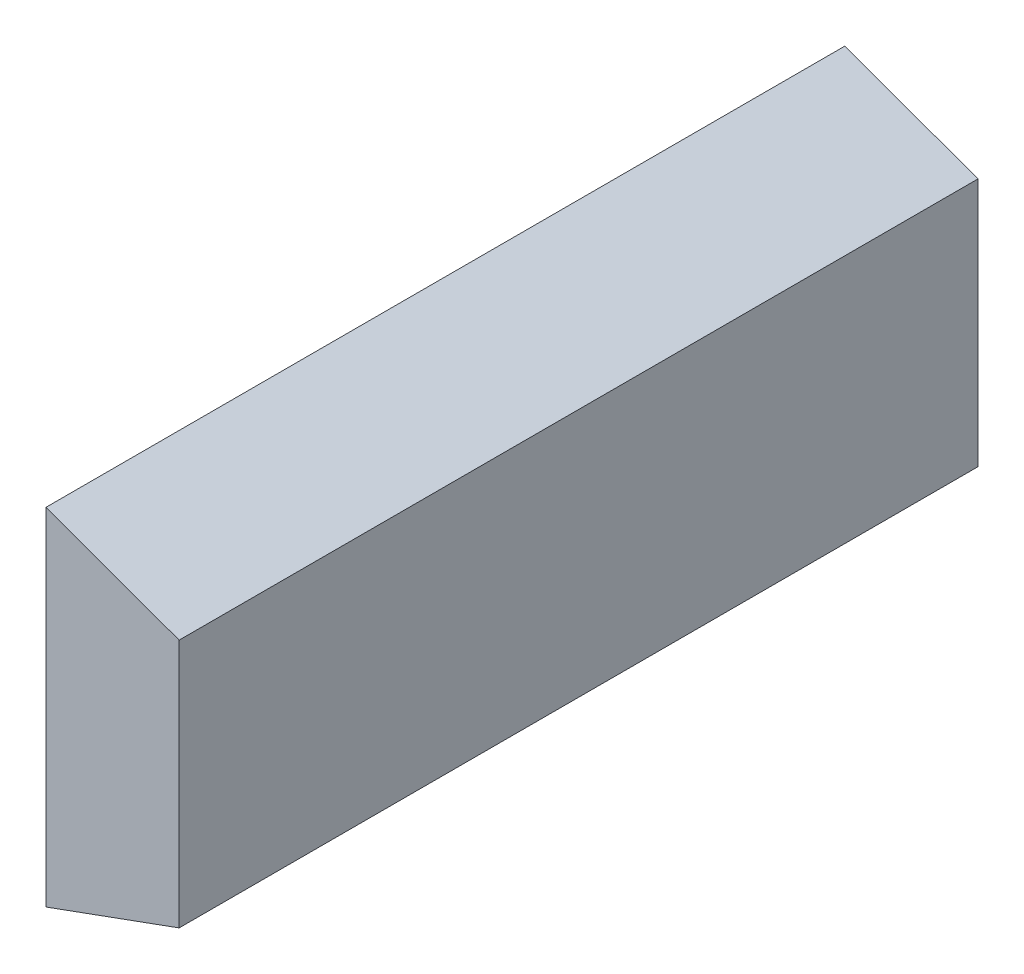
ISO-10303-21;
HEADER;
FILE_DESCRIPTION(('STEP AP214'),'2;1');
FILE_NAME('part.step','',(''),(''),'','','');
FILE_SCHEMA(('AUTOMOTIVE_DESIGN { 1 0 10303 214 1 1 1 1 }'));
ENDSEC;
DATA;
#1=APPLICATION_CONTEXT('core data for automotive mechanical design processes');
#2=APPLICATION_PROTOCOL_DEFINITION('international standard','automotive_design',2000,#1);
#3=PRODUCT_CONTEXT('',#1,'mechanical');
#4=PRODUCT('Part','Part','',(#3));
#5=PRODUCT_RELATED_PRODUCT_CATEGORY('part','',(#4));
#6=PRODUCT_DEFINITION_FORMATION('','',#4);
#7=PRODUCT_DEFINITION_CONTEXT('part definition',#1,'design');
#8=PRODUCT_DEFINITION('design','',#6,#7);
#9=PRODUCT_DEFINITION_SHAPE('','',#8);
#10=(LENGTH_UNIT() NAMED_UNIT(*) SI_UNIT(.MILLI.,.METRE.));
#11=(NAMED_UNIT(*) PLANE_ANGLE_UNIT() SI_UNIT($,.RADIAN.));
#12=(NAMED_UNIT(*) SI_UNIT($,.STERADIAN.) SOLID_ANGLE_UNIT());
#13=UNCERTAINTY_MEASURE_WITH_UNIT(LENGTH_MEASURE(1.E-05),#10,'distance_accuracy_value','');
#14=(GEOMETRIC_REPRESENTATION_CONTEXT(3) GLOBAL_UNCERTAINTY_ASSIGNED_CONTEXT((#13)) GLOBAL_UNIT_ASSIGNED_CONTEXT((#10,
#11,#12)) REPRESENTATION_CONTEXT('',''));
#15=CARTESIAN_POINT('',(0.,0.,0.));
#16=DIRECTION('',(0.,0.,1.));
#17=DIRECTION('',(1.,0.,0.));
#18=AXIS2_PLACEMENT_3D('',#15,#16,#17);
#19=CARTESIAN_POINT('',(61.7537089471515,-18.1549026853682,-15.));
#20=DIRECTION('',(0.34202014332567,0.939692620785908,0.));
#21=DIRECTION('',(-0.939692620785908,0.34202014332567,0.));
#22=AXIS2_PLACEMENT_3D('',#19,#20,#21);
#23=PLANE('',#22);
#24=DIRECTION('',(-0.939692620785908,0.34202014332567,0.));
#25=VECTOR('',#24,1.);
#26=CARTESIAN_POINT('',(61.7537089471515,-18.1549026853682,0.));
#27=LINE('',#26,#25);
#28=CARTESIAN_POINT('',(64.2537089471515,-19.0648282710337,0.));
#29=VERTEX_POINT('',#28);
#30=CARTESIAN_POINT('',(61.7537089471515,-18.1549026853682,0.));
#31=VERTEX_POINT('',#30);
#32=EDGE_CURVE('E97',#29,#31,#27,.T.);
#33=ORIENTED_EDGE('',*,*,#32,.F.);
#34=DIRECTION('',(0.,0.,1.));
#35=VECTOR('',#34,1.);
#36=CARTESIAN_POINT('',(64.2537089471515,-19.0648282710337,-15.));
#37=LINE('',#36,#35);
#38=CARTESIAN_POINT('',(64.2537089471515,-19.0648282710337,-15.));
#39=VERTEX_POINT('',#38);
#40=EDGE_CURVE('E11',#39,#29,#37,.T.);
#41=ORIENTED_EDGE('',*,*,#40,.F.);
#42=DIRECTION('',(-0.939692620785908,0.34202014332567,0.));
#43=VECTOR('',#42,1.);
#44=CARTESIAN_POINT('',(61.7537089471515,-18.1549026853682,-15.));
#45=LINE('',#44,#43);
#46=CARTESIAN_POINT('',(61.7537089471515,-18.1549026853682,-15.));
#47=VERTEX_POINT('',#46);
#48=EDGE_CURVE('E91',#39,#47,#45,.T.);
#49=ORIENTED_EDGE('',*,*,#48,.T.);
#50=DIRECTION('',(0.,0.,1.));
#51=VECTOR('',#50,1.);
#52=CARTESIAN_POINT('',(61.7537089471515,-18.1549026853682,-15.));
#53=LINE('',#52,#51);
#54=EDGE_CURVE('E36',#47,#31,#53,.T.);
#55=ORIENTED_EDGE('',*,*,#54,.T.);
#56=EDGE_LOOP('',(#33,#41,#49,#55));
#57=FACE_BOUND('',#56,.T.);
#58=ADVANCED_FACE('F33',(#57),#23,.T.);
#59=CARTESIAN_POINT('',(64.2537089471515,-19.0648282710337,-15.));
#60=DIRECTION('',(1.,0.,0.));
#61=DIRECTION('',(0.,0.,-1.));
#62=AXIS2_PLACEMENT_3D('',#59,#60,#61);
#63=PLANE('',#62);
#64=DIRECTION('',(0.,1.,0.));
#65=VECTOR('',#64,1.);
#66=CARTESIAN_POINT('',(64.2537089471515,-19.0648282710337,0.));
#67=LINE('',#66,#65);
#68=CARTESIAN_POINT('',(64.2537089471515,-23.7449770997027,0.));
#69=VERTEX_POINT('',#68);
#70=EDGE_CURVE('E93',#69,#29,#67,.T.);
#71=ORIENTED_EDGE('',*,*,#70,.F.);
#72=DIRECTION('',(0.,0.,1.));
#73=VECTOR('',#72,1.);
#74=CARTESIAN_POINT('',(64.2537089471515,-23.7449770997027,-15.));
#75=LINE('',#74,#73);
#76=CARTESIAN_POINT('',(64.2537089471515,-23.7449770997027,-15.));
#77=VERTEX_POINT('',#76);
#78=EDGE_CURVE('E42',#77,#69,#75,.T.);
#79=ORIENTED_EDGE('',*,*,#78,.F.);
#80=DIRECTION('',(0.,1.,0.));
#81=VECTOR('',#80,1.);
#82=CARTESIAN_POINT('',(64.2537089471515,-19.0648282710337,-15.));
#83=LINE('',#82,#81);
#84=EDGE_CURVE('E88',#77,#39,#83,.T.);
#85=ORIENTED_EDGE('',*,*,#84,.T.);
#86=ORIENTED_EDGE('',*,*,#40,.T.);
#87=EDGE_LOOP('',(#71,#79,#85,#86));
#88=FACE_BOUND('',#87,.T.);
#89=ADVANCED_FACE('F107',(#88),#63,.T.);
#90=CARTESIAN_POINT('',(64.2537089471515,-23.7449770997027,-15.));
#91=DIRECTION('',(0.342020143325663,-0.93969262078591,0.));
#92=DIRECTION('',(0.939692620785911,0.342020143325663,0.));
#93=AXIS2_PLACEMENT_3D('',#90,#91,#92);
#94=PLANE('',#93);
#95=DIRECTION('',(0.93969262078591,0.342020143325663,0.));
#96=VECTOR('',#95,1.);
#97=CARTESIAN_POINT('',(64.2537089471515,-23.7449770997027,0.));
#98=LINE('',#97,#96);
#99=CARTESIAN_POINT('',(61.7537089471515,-24.6549026853682,0.));
#100=VERTEX_POINT('',#99);
#101=EDGE_CURVE('E83',#100,#69,#98,.T.);
#102=ORIENTED_EDGE('',*,*,#101,.F.);
#103=DIRECTION('',(0.,0.,1.));
#104=VECTOR('',#103,1.);
#105=CARTESIAN_POINT('',(61.7537089471515,-24.6549026853682,-15.));
#106=LINE('',#105,#104);
#107=CARTESIAN_POINT('',(61.7537089471515,-24.6549026853682,-15.));
#108=VERTEX_POINT('',#107);
#109=EDGE_CURVE('E78',#108,#100,#106,.T.);
#110=ORIENTED_EDGE('',*,*,#109,.F.);
#111=DIRECTION('',(0.93969262078591,0.342020143325663,0.));
#112=VECTOR('',#111,1.);
#113=CARTESIAN_POINT('',(64.2537089471515,-23.7449770997027,-15.));
#114=LINE('',#113,#112);
#115=EDGE_CURVE('E81',#108,#77,#114,.T.);
#116=ORIENTED_EDGE('',*,*,#115,.T.);
#117=ORIENTED_EDGE('',*,*,#78,.T.);
#118=EDGE_LOOP('',(#102,#110,#116,#117));
#119=FACE_BOUND('',#118,.T.);
#120=ADVANCED_FACE('F80',(#119),#94,.T.);
#121=CARTESIAN_POINT('',(61.7537089471515,-18.1549026853682,-15.));
#122=DIRECTION('',(-1.,0.,0.));
#123=DIRECTION('',(0.,0.,1.));
#124=AXIS2_PLACEMENT_3D('',#121,#122,#123);
#125=PLANE('',#124);
#126=DIRECTION('',(0.,-1.,0.));
#127=VECTOR('',#126,1.);
#128=CARTESIAN_POINT('',(61.7537089471515,-18.1549026853682,0.));
#129=LINE('',#128,#127);
#130=EDGE_CURVE('E100',#31,#100,#129,.T.);
#131=ORIENTED_EDGE('',*,*,#130,.F.);
#132=ORIENTED_EDGE('',*,*,#54,.F.);
#133=DIRECTION('',(0.,-1.,0.));
#134=VECTOR('',#133,1.);
#135=CARTESIAN_POINT('',(61.7537089471515,-18.1549026853682,-15.));
#136=LINE('',#135,#134);
#137=EDGE_CURVE('E87',#47,#108,#136,.T.);
#138=ORIENTED_EDGE('',*,*,#137,.T.);
#139=ORIENTED_EDGE('',*,*,#109,.T.);
#140=EDGE_LOOP('',(#131,#132,#138,#139));
#141=FACE_BOUND('',#140,.T.);
#142=ADVANCED_FACE('F90',(#141),#125,.T.);
#143=CARTESIAN_POINT('',(0.,0.,-15.));
#144=DIRECTION('',(0.,0.,-1.));
#145=DIRECTION('',(-1.,0.,0.));
#146=AXIS2_PLACEMENT_3D('',#143,#144,#145);
#147=PLANE('',#146);
#148=ORIENTED_EDGE('',*,*,#48,.F.);
#149=ORIENTED_EDGE('',*,*,#84,.F.);
#150=ORIENTED_EDGE('',*,*,#115,.F.);
#151=ORIENTED_EDGE('',*,*,#137,.F.);
#152=EDGE_LOOP('',(#148,#149,#150,#151));
#153=FACE_BOUND('',#152,.T.);
#154=ADVANCED_FACE('F86',(#153),#147,.T.);
#155=CARTESIAN_POINT('',(0.,0.,0.));
#156=DIRECTION('',(0.,0.,-1.));
#157=DIRECTION('',(-1.,0.,0.));
#158=AXIS2_PLACEMENT_3D('',#155,#156,#157);
#159=PLANE('',#158);
#160=ORIENTED_EDGE('',*,*,#32,.T.);
#161=ORIENTED_EDGE('',*,*,#130,.T.);
#162=ORIENTED_EDGE('',*,*,#101,.T.);
#163=ORIENTED_EDGE('',*,*,#70,.T.);
#164=EDGE_LOOP('',(#160,#161,#162,#163));
#165=FACE_BOUND('',#164,.T.);
#166=ADVANCED_FACE('F106',(#165),#159,.F.);
#167=CLOSED_SHELL('',(#58,#89,#120,#142,#154,#166));
#168=MANIFOLD_SOLID_BREP('B2',#167);
#169=ADVANCED_BREP_SHAPE_REPRESENTATION('',(#18,#168),#14);
#170=SHAPE_DEFINITION_REPRESENTATION(#9,#169);
ENDSEC;
END-ISO-10303-21;
